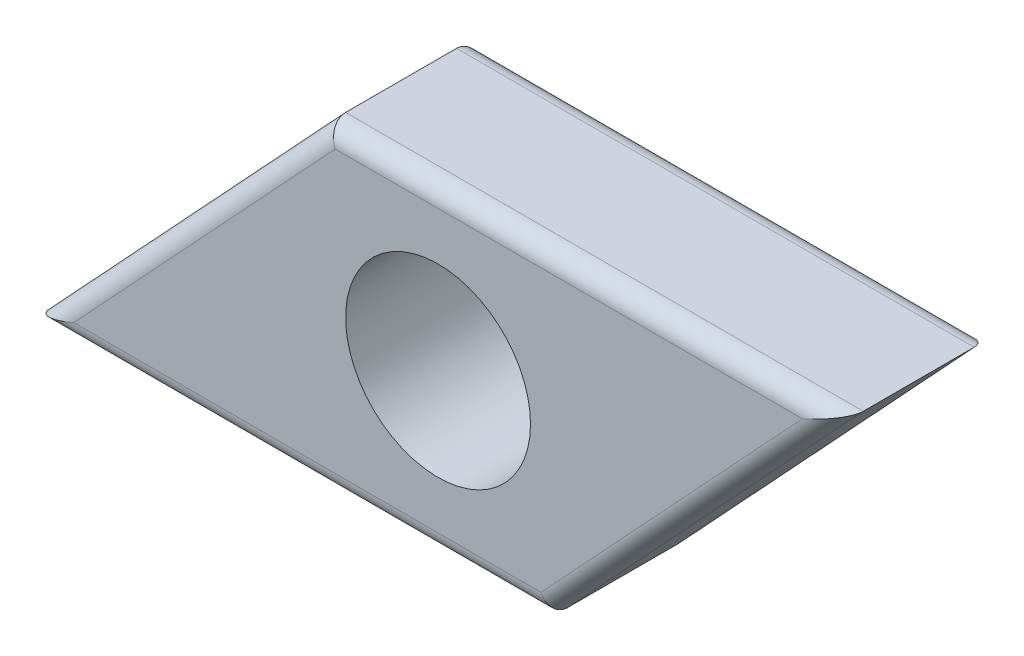
ISO-10303-21;
HEADER;
FILE_DESCRIPTION(('STEP AP214'),'2;1');
FILE_NAME('part.step','',(''),(''),'','','');
FILE_SCHEMA(('AUTOMOTIVE_DESIGN { 1 0 10303 214 1 1 1 1 }'));
ENDSEC;
DATA;
#1=APPLICATION_CONTEXT('core data for automotive mechanical design processes');
#2=APPLICATION_PROTOCOL_DEFINITION('international standard','automotive_design',2000,#1);
#3=PRODUCT_CONTEXT('',#1,'mechanical');
#4=PRODUCT('Part','Part','',(#3));
#5=PRODUCT_RELATED_PRODUCT_CATEGORY('part','',(#4));
#6=PRODUCT_DEFINITION_FORMATION('','',#4);
#7=PRODUCT_DEFINITION_CONTEXT('part definition',#1,'design');
#8=PRODUCT_DEFINITION('design','',#6,#7);
#9=PRODUCT_DEFINITION_SHAPE('','',#8);
#10=(LENGTH_UNIT() NAMED_UNIT(*) SI_UNIT(.MILLI.,.METRE.));
#11=(NAMED_UNIT(*) PLANE_ANGLE_UNIT() SI_UNIT($,.RADIAN.));
#12=(NAMED_UNIT(*) SI_UNIT($,.STERADIAN.) SOLID_ANGLE_UNIT());
#13=UNCERTAINTY_MEASURE_WITH_UNIT(LENGTH_MEASURE(1.E-05),#10,'distance_accuracy_value','');
#14=(GEOMETRIC_REPRESENTATION_CONTEXT(3) GLOBAL_UNCERTAINTY_ASSIGNED_CONTEXT((#13)) GLOBAL_UNIT_ASSIGNED_CONTEXT((#10,
#11,#12)) REPRESENTATION_CONTEXT('',''));
#15=CARTESIAN_POINT('',(0.,0.,0.));
#16=DIRECTION('',(0.,0.,1.));
#17=DIRECTION('',(1.,0.,0.));
#18=AXIS2_PLACEMENT_3D('',#15,#16,#17);
#19=CARTESIAN_POINT('',(0.,0.,4.));
#20=DIRECTION('',(0.,0.,-1.));
#21=DIRECTION('',(-1.,0.,0.));
#22=AXIS2_PLACEMENT_3D('',#19,#20,#21);
#23=PLANE('',#22);
#24=DIRECTION('',(1.,0.,0.));
#25=VECTOR('',#24,1.);
#26=CARTESIAN_POINT('',(0.,-3.8,4.));
#27=LINE('',#26,#25);
#28=CARTESIAN_POINT('',(-9.8519978204639,-3.8,4.));
#29=VERTEX_POINT('',#28);
#30=CARTESIAN_POINT('',(2.78223037860344,-3.8,4.));
#31=VERTEX_POINT('',#30);
#32=EDGE_CURVE('E115',#29,#31,#27,.T.);
#33=ORIENTED_EDGE('',*,*,#32,.T.);
#34=DIRECTION('',(0.681103942477287,0.732186738163084,0.));
#35=VECTOR('',#34,1.);
#36=CARTESIAN_POINT('',(3.38658856771173,-3.15031494670859,4.));
#37=LINE('',#36,#35);
#38=CARTESIAN_POINT('',(9.8519978204639,3.8,4.));
#39=VERTEX_POINT('',#38);
#40=EDGE_CURVE('E9',#31,#39,#37,.T.);
#41=ORIENTED_EDGE('',*,*,#40,.T.);
#42=DIRECTION('',(-1.,0.,0.));
#43=VECTOR('',#42,1.);
#44=CARTESIAN_POINT('',(0.,3.8,4.));
#45=LINE('',#44,#43);
#46=CARTESIAN_POINT('',(-2.78223037860344,3.8,4.));
#47=VERTEX_POINT('',#46);
#48=EDGE_CURVE('E24',#39,#47,#45,.T.);
#49=ORIENTED_EDGE('',*,*,#48,.T.);
#50=DIRECTION('',(-0.681103942477287,-0.732186738163084,0.));
#51=VECTOR('',#50,1.);
#52=CARTESIAN_POINT('',(-3.38658856771173,3.15031494670859,4.));
#53=LINE('',#52,#51);
#54=EDGE_CURVE('E133',#47,#29,#53,.T.);
#55=ORIENTED_EDGE('',*,*,#54,.T.);
#56=EDGE_LOOP('',(#33,#41,#49,#55));
#57=FACE_BOUND('',#56,.T.);
#58=CARTESIAN_POINT('',(0.,0.,4.));
#59=DIRECTION('',(0.,0.,1.));
#60=DIRECTION('',(1.,0.,0.));
#61=AXIS2_PLACEMENT_3D('',#58,#59,#60);
#62=CIRCLE('',#61,2.5);
#63=CARTESIAN_POINT('',(2.5,0.,4.));
#64=VERTEX_POINT('',#63);
#65=EDGE_CURVE('E160',#64,#64,#62,.T.);
#66=ORIENTED_EDGE('',*,*,#65,.F.);
#67=EDGE_LOOP('',(#66));
#68=FACE_BOUND('',#67,.T.);
#69=ADVANCED_FACE('F15',(#57,#68),#23,.F.);
#70=CARTESIAN_POINT('',(0.,0.,0.));
#71=DIRECTION('',(0.,0.,-1.));
#72=DIRECTION('',(-1.,0.,0.));
#73=AXIS2_PLACEMENT_3D('',#70,#71,#72);
#74=PLANE('',#73);
#75=DIRECTION('',(1.,0.,0.));
#76=VECTOR('',#75,1.);
#77=CARTESIAN_POINT('',(-11.,-3.8,0.));
#78=LINE('',#77,#76);
#79=CARTESIAN_POINT('',(2.78223037860344,-3.8,0.));
#80=VERTEX_POINT('',#79);
#81=CARTESIAN_POINT('',(-9.85199782046391,-3.8,0.));
#82=VERTEX_POINT('',#81);
#83=EDGE_CURVE('E151',#80,#82,#78,.F.);
#84=ORIENTED_EDGE('',*,*,#83,.T.);
#85=DIRECTION('',(-0.681103942477287,-0.732186738163084,0.));
#86=VECTOR('',#85,1.);
#87=CARTESIAN_POINT('',(-2.63390663091846,3.95944802876136,0.));
#88=LINE('',#87,#86);
#89=CARTESIAN_POINT('',(-2.78223037860344,3.8,0.));
#90=VERTEX_POINT('',#89);
#91=EDGE_CURVE('E144',#82,#90,#88,.F.);
#92=ORIENTED_EDGE('',*,*,#91,.T.);
#93=DIRECTION('',(-1.,0.,0.));
#94=VECTOR('',#93,1.);
#95=CARTESIAN_POINT('',(11.,3.8,0.));
#96=LINE('',#95,#94);
#97=CARTESIAN_POINT('',(9.8519978204639,3.8,0.));
#98=VERTEX_POINT('',#97);
#99=EDGE_CURVE('E147',#90,#98,#96,.F.);
#100=ORIENTED_EDGE('',*,*,#99,.T.);
#101=DIRECTION('',(0.681103942477287,0.732186738163084,0.));
#102=VECTOR('',#101,1.);
#103=CARTESIAN_POINT('',(2.63390663091846,-3.95944802876136,0.));
#104=LINE('',#103,#102);
#105=EDGE_CURVE('E149',#98,#80,#104,.F.);
#106=ORIENTED_EDGE('',*,*,#105,.T.);
#107=EDGE_LOOP('',(#84,#92,#100,#106));
#108=FACE_BOUND('',#107,.T.);
#109=CARTESIAN_POINT('',(0.,0.,0.));
#110=DIRECTION('',(0.,0.,1.));
#111=DIRECTION('',(1.,0.,0.));
#112=AXIS2_PLACEMENT_3D('',#109,#110,#111);
#113=CIRCLE('',#112,2.5);
#114=CARTESIAN_POINT('',(2.5,0.,0.));
#115=VERTEX_POINT('',#114);
#116=EDGE_CURVE('E127',#115,#115,#113,.T.);
#117=ORIENTED_EDGE('',*,*,#116,.T.);
#118=EDGE_LOOP('',(#117));
#119=FACE_BOUND('',#118,.T.);
#120=ADVANCED_FACE('F170',(#108,#119),#74,.T.);
#121=CARTESIAN_POINT('',(-11.,-4.3,4.));
#122=DIRECTION('',(0.732186738163084,-0.681103942477287,0.));
#123=DIRECTION('',(0.681103942477287,0.732186738163084,0.));
#124=AXIS2_PLACEMENT_3D('',#121,#122,#123);
#125=PLANE('',#124);
#126=DIRECTION('',(0.,0.,-1.));
#127=VECTOR('',#126,1.);
#128=CARTESIAN_POINT('',(-3.,4.3,4.));
#129=LINE('',#128,#127);
#130=CARTESIAN_POINT('',(-3.,4.3,3.5));
#131=VERTEX_POINT('',#130);
#132=CARTESIAN_POINT('',(-3.,4.3,0.5));
#133=VERTEX_POINT('',#132);
#134=EDGE_CURVE('E158',#131,#133,#129,.T.);
#135=ORIENTED_EDGE('',*,*,#134,.T.);
#136=DIRECTION('',(-0.681103942477287,-0.732186738163084,0.));
#137=VECTOR('',#136,1.);
#138=CARTESIAN_POINT('',(-11.,-4.3,0.5));
#139=LINE('',#138,#137);
#140=CARTESIAN_POINT('',(-11.,-4.3,0.5));
#141=VERTEX_POINT('',#140);
#142=EDGE_CURVE('E104',#133,#141,#139,.T.);
#143=ORIENTED_EDGE('',*,*,#142,.T.);
#144=DIRECTION('',(0.,0.,-1.));
#145=VECTOR('',#144,1.);
#146=CARTESIAN_POINT('',(-11.,-4.3,4.));
#147=LINE('',#146,#145);
#148=CARTESIAN_POINT('',(-11.,-4.3,3.5));
#149=VERTEX_POINT('',#148);
#150=EDGE_CURVE('E86',#149,#141,#147,.T.);
#151=ORIENTED_EDGE('',*,*,#150,.F.);
#152=DIRECTION('',(-0.681103942477287,-0.732186738163084,0.));
#153=VECTOR('',#152,1.);
#154=CARTESIAN_POINT('',(-11.,-4.3,3.5));
#155=LINE('',#154,#153);
#156=EDGE_CURVE('E101',#149,#131,#155,.F.);
#157=ORIENTED_EDGE('',*,*,#156,.T.);
#158=EDGE_LOOP('',(#135,#143,#151,#157));
#159=FACE_BOUND('',#158,.T.);
#160=ADVANCED_FACE('F100',(#159),#125,.F.);
#161=CARTESIAN_POINT('',(3.,-4.3,4.));
#162=DIRECTION('',(0.,1.,0.));
#163=DIRECTION('',(0.,0.,1.));
#164=AXIS2_PLACEMENT_3D('',#161,#162,#163);
#165=PLANE('',#164);
#166=ORIENTED_EDGE('',*,*,#150,.T.);
#167=DIRECTION('',(1.,0.,0.));
#168=VECTOR('',#167,1.);
#169=CARTESIAN_POINT('',(3.,-4.3,0.5));
#170=LINE('',#169,#168);
#171=CARTESIAN_POINT('',(3.,-4.3,0.5));
#172=VERTEX_POINT('',#171);
#173=EDGE_CURVE('E93',#141,#172,#170,.T.);
#174=ORIENTED_EDGE('',*,*,#173,.T.);
#175=DIRECTION('',(0.,0.,-1.));
#176=VECTOR('',#175,1.);
#177=CARTESIAN_POINT('',(3.,-4.3,4.));
#178=LINE('',#177,#176);
#179=CARTESIAN_POINT('',(3.,-4.3,3.5));
#180=VERTEX_POINT('',#179);
#181=EDGE_CURVE('E88',#180,#172,#178,.T.);
#182=ORIENTED_EDGE('',*,*,#181,.F.);
#183=DIRECTION('',(1.,0.,0.));
#184=VECTOR('',#183,1.);
#185=CARTESIAN_POINT('',(3.,-4.3,3.5));
#186=LINE('',#185,#184);
#187=EDGE_CURVE('E83',#180,#149,#186,.F.);
#188=ORIENTED_EDGE('',*,*,#187,.T.);
#189=EDGE_LOOP('',(#166,#174,#182,#188));
#190=FACE_BOUND('',#189,.T.);
#191=ADVANCED_FACE('F85',(#190),#165,.F.);
#192=CARTESIAN_POINT('',(11.,4.3,4.));
#193=DIRECTION('',(-0.732186738163084,0.681103942477287,0.));
#194=DIRECTION('',(-0.681103942477287,-0.732186738163084,0.));
#195=AXIS2_PLACEMENT_3D('',#192,#193,#194);
#196=PLANE('',#195);
#197=ORIENTED_EDGE('',*,*,#181,.T.);
#198=DIRECTION('',(0.681103942477287,0.732186738163084,0.));
#199=VECTOR('',#198,1.);
#200=CARTESIAN_POINT('',(11.,4.3,0.5));
#201=LINE('',#200,#199);
#202=CARTESIAN_POINT('',(11.,4.3,0.5));
#203=VERTEX_POINT('',#202);
#204=EDGE_CURVE('E94',#172,#203,#201,.T.);
#205=ORIENTED_EDGE('',*,*,#204,.T.);
#206=DIRECTION('',(0.,0.,-1.));
#207=VECTOR('',#206,1.);
#208=CARTESIAN_POINT('',(11.,4.3,4.));
#209=LINE('',#208,#207);
#210=CARTESIAN_POINT('',(11.,4.3,3.5));
#211=VERTEX_POINT('',#210);
#212=EDGE_CURVE('E155',#211,#203,#209,.T.);
#213=ORIENTED_EDGE('',*,*,#212,.F.);
#214=DIRECTION('',(0.681103942477287,0.732186738163084,0.));
#215=VECTOR('',#214,1.);
#216=CARTESIAN_POINT('',(11.,4.3,3.5));
#217=LINE('',#216,#215);
#218=EDGE_CURVE('E138',#211,#180,#217,.F.);
#219=ORIENTED_EDGE('',*,*,#218,.T.);
#220=EDGE_LOOP('',(#197,#205,#213,#219));
#221=FACE_BOUND('',#220,.T.);
#222=ADVANCED_FACE('F183',(#221),#196,.F.);
#223=CARTESIAN_POINT('',(-3.,4.3,4.));
#224=DIRECTION('',(0.,-1.,0.));
#225=DIRECTION('',(0.,0.,-1.));
#226=AXIS2_PLACEMENT_3D('',#223,#224,#225);
#227=PLANE('',#226);
#228=ORIENTED_EDGE('',*,*,#212,.T.);
#229=DIRECTION('',(-1.,0.,0.));
#230=VECTOR('',#229,1.);
#231=CARTESIAN_POINT('',(-3.,4.3,0.5));
#232=LINE('',#231,#230);
#233=EDGE_CURVE('E140',#203,#133,#232,.T.);
#234=ORIENTED_EDGE('',*,*,#233,.T.);
#235=ORIENTED_EDGE('',*,*,#134,.F.);
#236=DIRECTION('',(-1.,0.,0.));
#237=VECTOR('',#236,1.);
#238=CARTESIAN_POINT('',(-3.,4.3,3.5));
#239=LINE('',#238,#237);
#240=EDGE_CURVE('E142',#131,#211,#239,.F.);
#241=ORIENTED_EDGE('',*,*,#240,.T.);
#242=EDGE_LOOP('',(#228,#234,#235,#241));
#243=FACE_BOUND('',#242,.T.);
#244=ADVANCED_FACE('F180',(#243),#227,.F.);
#245=CARTESIAN_POINT('',(0.,0.,4.));
#246=DIRECTION('',(0.,0.,-1.));
#247=DIRECTION('',(-1.,0.,0.));
#248=AXIS2_PLACEMENT_3D('',#245,#246,#247);
#249=CYLINDRICAL_SURFACE('',#248,2.5);
#250=ORIENTED_EDGE('',*,*,#65,.T.);
#251=EDGE_LOOP('',(#250));
#252=FACE_BOUND('',#251,.T.);
#253=ORIENTED_EDGE('',*,*,#116,.F.);
#254=EDGE_LOOP('',(#253));
#255=FACE_BOUND('',#254,.T.);
#256=ADVANCED_FACE('F166',(#252,#255),#249,.F.);
#257=CARTESIAN_POINT('',(10.6339066309185,4.64055197123864,0.5));
#258=DIRECTION('',(-0.681103942477287,-0.732186738163084,0.));
#259=DIRECTION('',(0.732186738163084,-0.681103942477287,0.));
#260=AXIS2_PLACEMENT_3D('',#257,#258,#259);
#261=CYLINDRICAL_SURFACE('',#260,0.5);
#262=CARTESIAN_POINT('',(2.78223037860344,-3.8,0.5));
#263=DIRECTION('',(-0.916816214537376,-0.399309439860062,0.));
#264=DIRECTION('',(-0.399309439860062,0.916816214537376,0.));
#265=AXIS2_PLACEMENT_3D('',#262,#263,#264);
#266=ELLIPSE('',#265,0.545365572807086,0.5);
#267=EDGE_CURVE('E128',#80,#172,#266,.T.);
#268=ORIENTED_EDGE('',*,*,#267,.F.);
#269=ORIENTED_EDGE('',*,*,#105,.F.);
#270=CARTESIAN_POINT('',(9.8519978204639,3.8,0.5));
#271=DIRECTION('',(0.399309439860062,-0.916816214537376,0.));
#272=DIRECTION('',(-0.916816214537376,-0.399309439860062,0.));
#273=AXIS2_PLACEMENT_3D('',#270,#271,#272);
#274=ELLIPSE('',#273,1.25216173245297,0.5);
#275=EDGE_CURVE('E124',#203,#98,#274,.F.);
#276=ORIENTED_EDGE('',*,*,#275,.F.);
#277=ORIENTED_EDGE('',*,*,#204,.F.);
#278=EDGE_LOOP('',(#268,#269,#276,#277));
#279=FACE_BOUND('',#278,.T.);
#280=ADVANCED_FACE('F203',(#279),#261,.T.);
#281=CARTESIAN_POINT('',(-3.,3.8,0.5));
#282=DIRECTION('',(1.,0.,0.));
#283=DIRECTION('',(0.,0.,-1.));
#284=AXIS2_PLACEMENT_3D('',#281,#282,#283);
#285=CYLINDRICAL_SURFACE('',#284,0.5);
#286=ORIENTED_EDGE('',*,*,#275,.T.);
#287=ORIENTED_EDGE('',*,*,#99,.F.);
#288=CARTESIAN_POINT('',(-2.78223037860344,3.8,0.5));
#289=DIRECTION('',(0.916816214537376,0.399309439860062,0.));
#290=DIRECTION('',(0.399309439860062,-0.916816214537376,0.));
#291=AXIS2_PLACEMENT_3D('',#288,#289,#290);
#292=ELLIPSE('',#291,0.545365572807086,0.5);
#293=EDGE_CURVE('E117',#133,#90,#292,.F.);
#294=ORIENTED_EDGE('',*,*,#293,.F.);
#295=ORIENTED_EDGE('',*,*,#233,.F.);
#296=EDGE_LOOP('',(#286,#287,#294,#295));
#297=FACE_BOUND('',#296,.T.);
#298=ADVANCED_FACE('F199',(#297),#285,.T.);
#299=CARTESIAN_POINT('',(3.,-3.8,0.5));
#300=DIRECTION('',(-1.,0.,0.));
#301=DIRECTION('',(0.,0.,1.));
#302=AXIS2_PLACEMENT_3D('',#299,#300,#301);
#303=CYLINDRICAL_SURFACE('',#302,0.5);
#304=ORIENTED_EDGE('',*,*,#267,.T.);
#305=ORIENTED_EDGE('',*,*,#173,.F.);
#306=CARTESIAN_POINT('',(-9.8519978204639,-3.8,0.5));
#307=DIRECTION('',(-0.399309439860062,0.916816214537376,0.));
#308=DIRECTION('',(-0.916816214537376,-0.399309439860062,0.));
#309=AXIS2_PLACEMENT_3D('',#306,#307,#308);
#310=ELLIPSE('',#309,1.25216173245297,0.5);
#311=EDGE_CURVE('E116',#82,#141,#310,.T.);
#312=ORIENTED_EDGE('',*,*,#311,.F.);
#313=ORIENTED_EDGE('',*,*,#83,.F.);
#314=EDGE_LOOP('',(#304,#305,#312,#313));
#315=FACE_BOUND('',#314,.T.);
#316=ADVANCED_FACE('F195',(#315),#303,.T.);
#317=CARTESIAN_POINT('',(-10.6339066309185,-4.64055197123864,0.5));
#318=DIRECTION('',(0.681103942477287,0.732186738163084,0.));
#319=DIRECTION('',(-0.732186738163084,0.681103942477287,0.));
#320=AXIS2_PLACEMENT_3D('',#317,#318,#319);
#321=CYLINDRICAL_SURFACE('',#320,0.5);
#322=ORIENTED_EDGE('',*,*,#293,.T.);
#323=ORIENTED_EDGE('',*,*,#91,.F.);
#324=ORIENTED_EDGE('',*,*,#311,.T.);
#325=ORIENTED_EDGE('',*,*,#142,.F.);
#326=EDGE_LOOP('',(#322,#323,#324,#325));
#327=FACE_BOUND('',#326,.T.);
#328=ADVANCED_FACE('F192',(#327),#321,.T.);
#329=CARTESIAN_POINT('',(-3.38658856771173,3.15031494670859,3.5));
#330=DIRECTION('',(-0.681103942477287,-0.732186738163084,0.));
#331=DIRECTION('',(0.732186738163084,-0.681103942477287,0.));
#332=AXIS2_PLACEMENT_3D('',#329,#330,#331);
#333=CYLINDRICAL_SURFACE('',#332,0.5);
#334=CARTESIAN_POINT('',(-2.78223037860344,3.8,3.5));
#335=DIRECTION('',(-0.916816214537376,-0.399309439860062,0.));
#336=DIRECTION('',(0.399309439860062,-0.916816214537376,0.));
#337=AXIS2_PLACEMENT_3D('',#334,#335,#336);
#338=ELLIPSE('',#337,0.545365572807086,0.5);
#339=EDGE_CURVE('E111',#131,#47,#338,.F.);
#340=ORIENTED_EDGE('',*,*,#339,.F.);
#341=ORIENTED_EDGE('',*,*,#156,.F.);
#342=CARTESIAN_POINT('',(-9.8519978204639,-3.8,3.5));
#343=DIRECTION('',(0.399309439860062,-0.916816214537376,0.));
#344=DIRECTION('',(0.916816214537376,0.399309439860062,0.));
#345=AXIS2_PLACEMENT_3D('',#342,#343,#344);
#346=ELLIPSE('',#345,1.25216173245297,0.5);
#347=EDGE_CURVE('E19',#29,#149,#346,.T.);
#348=ORIENTED_EDGE('',*,*,#347,.F.);
#349=ORIENTED_EDGE('',*,*,#54,.F.);
#350=EDGE_LOOP('',(#340,#341,#348,#349));
#351=FACE_BOUND('',#350,.T.);
#352=ADVANCED_FACE('F17',(#351),#333,.T.);
#353=CARTESIAN_POINT('',(0.,-3.8,3.5));
#354=DIRECTION('',(1.,0.,0.));
#355=DIRECTION('',(0.,0.,-1.));
#356=AXIS2_PLACEMENT_3D('',#353,#354,#355);
#357=CYLINDRICAL_SURFACE('',#356,0.5);
#358=ORIENTED_EDGE('',*,*,#347,.T.);
#359=ORIENTED_EDGE('',*,*,#187,.F.);
#360=CARTESIAN_POINT('',(2.78223037860344,-3.8,3.5));
#361=DIRECTION('',(0.916816214537376,0.399309439860062,0.));
#362=DIRECTION('',(0.399309439860062,-0.916816214537376,0.));
#363=AXIS2_PLACEMENT_3D('',#360,#361,#362);
#364=ELLIPSE('',#363,0.545365572807086,0.5);
#365=EDGE_CURVE('E119',#31,#180,#364,.T.);
#366=ORIENTED_EDGE('',*,*,#365,.F.);
#367=ORIENTED_EDGE('',*,*,#32,.F.);
#368=EDGE_LOOP('',(#358,#359,#366,#367));
#369=FACE_BOUND('',#368,.T.);
#370=ADVANCED_FACE('F114',(#369),#357,.T.);
#371=CARTESIAN_POINT('',(0.,3.8,3.5));
#372=DIRECTION('',(-1.,0.,0.));
#373=DIRECTION('',(0.,0.,1.));
#374=AXIS2_PLACEMENT_3D('',#371,#372,#373);
#375=CYLINDRICAL_SURFACE('',#374,0.5);
#376=ORIENTED_EDGE('',*,*,#339,.T.);
#377=ORIENTED_EDGE('',*,*,#48,.F.);
#378=CARTESIAN_POINT('',(9.8519978204639,3.8,3.5));
#379=DIRECTION('',(-0.399309439860062,0.916816214537376,0.));
#380=DIRECTION('',(-0.916816214537376,-0.399309439860062,0.));
#381=AXIS2_PLACEMENT_3D('',#378,#379,#380);
#382=ELLIPSE('',#381,1.25216173245297,0.5);
#383=EDGE_CURVE('E32',#211,#39,#382,.F.);
#384=ORIENTED_EDGE('',*,*,#383,.F.);
#385=ORIENTED_EDGE('',*,*,#240,.F.);
#386=EDGE_LOOP('',(#376,#377,#384,#385));
#387=FACE_BOUND('',#386,.T.);
#388=ADVANCED_FACE('F211',(#387),#375,.T.);
#389=CARTESIAN_POINT('',(3.38658856771173,-3.15031494670859,3.5));
#390=DIRECTION('',(0.681103942477287,0.732186738163084,0.));
#391=DIRECTION('',(-0.732186738163084,0.681103942477287,0.));
#392=AXIS2_PLACEMENT_3D('',#389,#390,#391);
#393=CYLINDRICAL_SURFACE('',#392,0.5);
#394=ORIENTED_EDGE('',*,*,#365,.T.);
#395=ORIENTED_EDGE('',*,*,#218,.F.);
#396=ORIENTED_EDGE('',*,*,#383,.T.);
#397=ORIENTED_EDGE('',*,*,#40,.F.);
#398=EDGE_LOOP('',(#394,#395,#396,#397));
#399=FACE_BOUND('',#398,.T.);
#400=ADVANCED_FACE('F208',(#399),#393,.T.);
#401=CLOSED_SHELL('',(#69,#120,#160,#191,#222,#244,#256,#280,#298,#316,#328,#352,#370,#388,#400));
#402=MANIFOLD_SOLID_BREP('B1',#401);
#403=ADVANCED_BREP_SHAPE_REPRESENTATION('',(#18,#402),#14);
#404=SHAPE_DEFINITION_REPRESENTATION(#9,#403);
ENDSEC;
END-ISO-10303-21;
